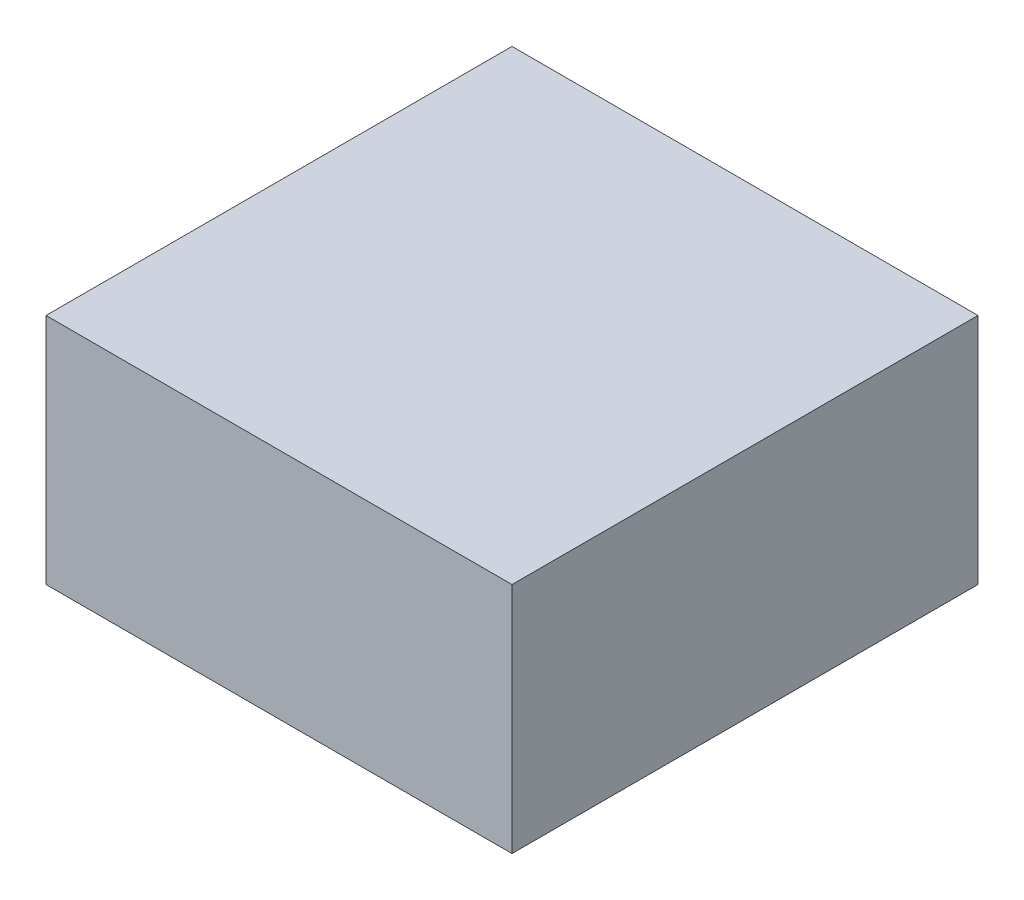
ISO-10303-21;
HEADER;
FILE_DESCRIPTION(('STEP AP214'),'2;1');
FILE_NAME('part.step','',(''),(''),'','','');
FILE_SCHEMA(('AUTOMOTIVE_DESIGN { 1 0 10303 214 1 1 1 1 }'));
ENDSEC;
DATA;
#1=APPLICATION_CONTEXT('core data for automotive mechanical design processes');
#2=APPLICATION_PROTOCOL_DEFINITION('international standard','automotive_design',2000,#1);
#3=PRODUCT_CONTEXT('',#1,'mechanical');
#4=PRODUCT('Part','Part','',(#3));
#5=PRODUCT_RELATED_PRODUCT_CATEGORY('part','',(#4));
#6=PRODUCT_DEFINITION_FORMATION('','',#4);
#7=PRODUCT_DEFINITION_CONTEXT('part definition',#1,'design');
#8=PRODUCT_DEFINITION('design','',#6,#7);
#9=PRODUCT_DEFINITION_SHAPE('','',#8);
#10=(LENGTH_UNIT() NAMED_UNIT(*) SI_UNIT(.MILLI.,.METRE.));
#11=(NAMED_UNIT(*) PLANE_ANGLE_UNIT() SI_UNIT($,.RADIAN.));
#12=(NAMED_UNIT(*) SI_UNIT($,.STERADIAN.) SOLID_ANGLE_UNIT());
#13=UNCERTAINTY_MEASURE_WITH_UNIT(LENGTH_MEASURE(1.E-05),#10,'distance_accuracy_value','');
#14=(GEOMETRIC_REPRESENTATION_CONTEXT(3) GLOBAL_UNCERTAINTY_ASSIGNED_CONTEXT((#13)) GLOBAL_UNIT_ASSIGNED_CONTEXT((#10,
#11,#12)) REPRESENTATION_CONTEXT('',''));
#15=CARTESIAN_POINT('',(0.,0.,0.));
#16=DIRECTION('',(0.,0.,1.));
#17=DIRECTION('',(1.,0.,0.));
#18=AXIS2_PLACEMENT_3D('',#15,#16,#17);
#19=CARTESIAN_POINT('',(0.,1.,0.));
#20=DIRECTION('',(1.,0.,0.));
#21=DIRECTION('',(0.,0.,-1.));
#22=AXIS2_PLACEMENT_3D('',#19,#20,#21);
#23=PLANE('',#22);
#24=DIRECTION('',(0.,0.,1.));
#25=VECTOR('',#24,1.);
#26=CARTESIAN_POINT('',(0.,0.,0.));
#27=LINE('',#26,#25);
#28=CARTESIAN_POINT('',(0.,0.,-2.));
#29=VERTEX_POINT('',#28);
#30=CARTESIAN_POINT('',(0.,0.,0.));
#31=VERTEX_POINT('',#30);
#32=EDGE_CURVE('E97',#29,#31,#27,.T.);
#33=ORIENTED_EDGE('',*,*,#32,.T.);
#34=DIRECTION('',(0.,-1.,0.));
#35=VECTOR('',#34,1.);
#36=CARTESIAN_POINT('',(0.,1.,0.));
#37=LINE('',#36,#35);
#38=CARTESIAN_POINT('',(0.,1.,0.));
#39=VERTEX_POINT('',#38);
#40=EDGE_CURVE('E11',#39,#31,#37,.T.);
#41=ORIENTED_EDGE('',*,*,#40,.F.);
#42=DIRECTION('',(0.,0.,1.));
#43=VECTOR('',#42,1.);
#44=CARTESIAN_POINT('',(0.,1.,0.));
#45=LINE('',#44,#43);
#46=CARTESIAN_POINT('',(0.,1.,-2.));
#47=VERTEX_POINT('',#46);
#48=EDGE_CURVE('E85',#47,#39,#45,.T.);
#49=ORIENTED_EDGE('',*,*,#48,.F.);
#50=DIRECTION('',(0.,-1.,0.));
#51=VECTOR('',#50,1.);
#52=CARTESIAN_POINT('',(0.,1.,-2.));
#53=LINE('',#52,#51);
#54=EDGE_CURVE('E93',#47,#29,#53,.T.);
#55=ORIENTED_EDGE('',*,*,#54,.T.);
#56=EDGE_LOOP('',(#33,#41,#49,#55));
#57=FACE_BOUND('',#56,.T.);
#58=ADVANCED_FACE('F34',(#57),#23,.F.);
#59=CARTESIAN_POINT('',(0.,1.,0.));
#60=DIRECTION('',(0.,0.,-1.));
#61=DIRECTION('',(-1.,0.,0.));
#62=AXIS2_PLACEMENT_3D('',#59,#60,#61);
#63=PLANE('',#62);
#64=DIRECTION('',(1.,0.,0.));
#65=VECTOR('',#64,1.);
#66=CARTESIAN_POINT('',(0.,0.,0.));
#67=LINE('',#66,#65);
#68=CARTESIAN_POINT('',(2.,0.,0.));
#69=VERTEX_POINT('',#68);
#70=EDGE_CURVE('E89',#31,#69,#67,.T.);
#71=ORIENTED_EDGE('',*,*,#70,.T.);
#72=DIRECTION('',(0.,-1.,0.));
#73=VECTOR('',#72,1.);
#74=CARTESIAN_POINT('',(2.,1.,0.));
#75=LINE('',#74,#73);
#76=CARTESIAN_POINT('',(2.,1.,0.));
#77=VERTEX_POINT('',#76);
#78=EDGE_CURVE('E42',#77,#69,#75,.T.);
#79=ORIENTED_EDGE('',*,*,#78,.F.);
#80=DIRECTION('',(1.,0.,0.));
#81=VECTOR('',#80,1.);
#82=CARTESIAN_POINT('',(0.,1.,0.));
#83=LINE('',#82,#81);
#84=EDGE_CURVE('E80',#39,#77,#83,.T.);
#85=ORIENTED_EDGE('',*,*,#84,.F.);
#86=ORIENTED_EDGE('',*,*,#40,.T.);
#87=EDGE_LOOP('',(#71,#79,#85,#86));
#88=FACE_BOUND('',#87,.T.);
#89=ADVANCED_FACE('F88',(#88),#63,.F.);
#90=CARTESIAN_POINT('',(2.,1.,0.));
#91=DIRECTION('',(-1.,0.,0.));
#92=DIRECTION('',(0.,0.,1.));
#93=AXIS2_PLACEMENT_3D('',#90,#91,#92);
#94=PLANE('',#93);
#95=DIRECTION('',(0.,0.,-1.));
#96=VECTOR('',#95,1.);
#97=CARTESIAN_POINT('',(2.,0.,0.));
#98=LINE('',#97,#96);
#99=CARTESIAN_POINT('',(2.,0.,-2.));
#100=VERTEX_POINT('',#99);
#101=EDGE_CURVE('E67',#69,#100,#98,.T.);
#102=ORIENTED_EDGE('',*,*,#101,.T.);
#103=DIRECTION('',(0.,-1.,0.));
#104=VECTOR('',#103,1.);
#105=CARTESIAN_POINT('',(2.,1.,-2.));
#106=LINE('',#105,#104);
#107=CARTESIAN_POINT('',(2.,1.,-2.));
#108=VERTEX_POINT('',#107);
#109=EDGE_CURVE('E90',#108,#100,#106,.T.);
#110=ORIENTED_EDGE('',*,*,#109,.F.);
#111=DIRECTION('',(0.,0.,-1.));
#112=VECTOR('',#111,1.);
#113=CARTESIAN_POINT('',(2.,1.,0.));
#114=LINE('',#113,#112);
#115=EDGE_CURVE('E83',#77,#108,#114,.T.);
#116=ORIENTED_EDGE('',*,*,#115,.F.);
#117=ORIENTED_EDGE('',*,*,#78,.T.);
#118=EDGE_LOOP('',(#102,#110,#116,#117));
#119=FACE_BOUND('',#118,.T.);
#120=ADVANCED_FACE('F91',(#119),#94,.F.);
#121=CARTESIAN_POINT('',(0.,1.,-2.));
#122=DIRECTION('',(0.,0.,1.));
#123=DIRECTION('',(1.,0.,0.));
#124=AXIS2_PLACEMENT_3D('',#121,#122,#123);
#125=PLANE('',#124);
#126=DIRECTION('',(-1.,0.,0.));
#127=VECTOR('',#126,1.);
#128=CARTESIAN_POINT('',(0.,0.,-2.));
#129=LINE('',#128,#127);
#130=EDGE_CURVE('E73',#100,#29,#129,.T.);
#131=ORIENTED_EDGE('',*,*,#130,.T.);
#132=ORIENTED_EDGE('',*,*,#54,.F.);
#133=DIRECTION('',(-1.,0.,0.));
#134=VECTOR('',#133,1.);
#135=CARTESIAN_POINT('',(0.,1.,-2.));
#136=LINE('',#135,#134);
#137=EDGE_CURVE('E50',#108,#47,#136,.T.);
#138=ORIENTED_EDGE('',*,*,#137,.F.);
#139=ORIENTED_EDGE('',*,*,#109,.T.);
#140=EDGE_LOOP('',(#131,#132,#138,#139));
#141=FACE_BOUND('',#140,.T.);
#142=ADVANCED_FACE('F104',(#141),#125,.F.);
#143=CARTESIAN_POINT('',(0.,1.,0.));
#144=DIRECTION('',(0.,-1.,0.));
#145=DIRECTION('',(0.,0.,-1.));
#146=AXIS2_PLACEMENT_3D('',#143,#144,#145);
#147=PLANE('',#146);
#148=ORIENTED_EDGE('',*,*,#48,.T.);
#149=ORIENTED_EDGE('',*,*,#84,.T.);
#150=ORIENTED_EDGE('',*,*,#115,.T.);
#151=ORIENTED_EDGE('',*,*,#137,.T.);
#152=EDGE_LOOP('',(#148,#149,#150,#151));
#153=FACE_BOUND('',#152,.T.);
#154=ADVANCED_FACE('F81',(#153),#147,.F.);
#155=CARTESIAN_POINT('',(0.,0.,0.));
#156=DIRECTION('',(0.,-1.,0.));
#157=DIRECTION('',(0.,0.,-1.));
#158=AXIS2_PLACEMENT_3D('',#155,#156,#157);
#159=PLANE('',#158);
#160=ORIENTED_EDGE('',*,*,#32,.F.);
#161=ORIENTED_EDGE('',*,*,#130,.F.);
#162=ORIENTED_EDGE('',*,*,#101,.F.);
#163=ORIENTED_EDGE('',*,*,#70,.F.);
#164=EDGE_LOOP('',(#160,#161,#162,#163));
#165=FACE_BOUND('',#164,.T.);
#166=ADVANCED_FACE('F107',(#165),#159,.T.);
#167=CLOSED_SHELL('',(#58,#89,#120,#142,#154,#166));
#168=MANIFOLD_SOLID_BREP('B2',#167);
#169=ADVANCED_BREP_SHAPE_REPRESENTATION('',(#18,#168),#14);
#170=SHAPE_DEFINITION_REPRESENTATION(#9,#169);
ENDSEC;
END-ISO-10303-21;
